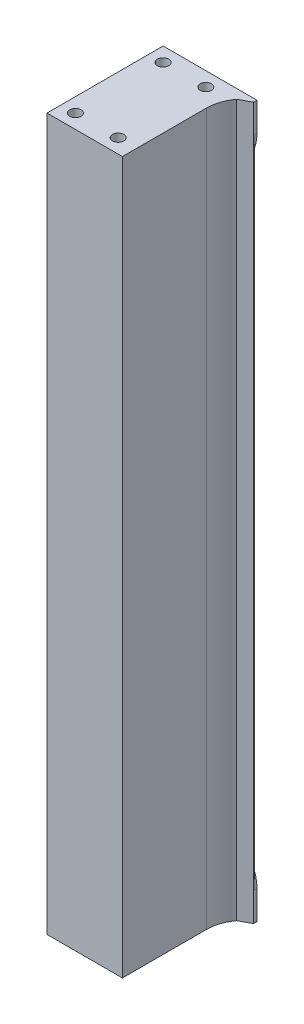
ISO-10303-21;
HEADER;
FILE_DESCRIPTION(('STEP AP214'),'2;1');
FILE_NAME('part.step','',(''),(''),'','','');
FILE_SCHEMA(('AUTOMOTIVE_DESIGN { 1 0 10303 214 1 1 1 1 }'));
ENDSEC;
DATA;
#1=APPLICATION_CONTEXT('core data for automotive mechanical design processes');
#2=APPLICATION_PROTOCOL_DEFINITION('international standard','automotive_design',2000,#1);
#3=PRODUCT_CONTEXT('',#1,'mechanical');
#4=PRODUCT('Part','Part','',(#3));
#5=PRODUCT_RELATED_PRODUCT_CATEGORY('part','',(#4));
#6=PRODUCT_DEFINITION_FORMATION('','',#4);
#7=PRODUCT_DEFINITION_CONTEXT('part definition',#1,'design');
#8=PRODUCT_DEFINITION('design','',#6,#7);
#9=PRODUCT_DEFINITION_SHAPE('','',#8);
#10=(LENGTH_UNIT() NAMED_UNIT(*) SI_UNIT(.MILLI.,.METRE.));
#11=(NAMED_UNIT(*) PLANE_ANGLE_UNIT() SI_UNIT($,.RADIAN.));
#12=(NAMED_UNIT(*) SI_UNIT($,.STERADIAN.) SOLID_ANGLE_UNIT());
#13=UNCERTAINTY_MEASURE_WITH_UNIT(LENGTH_MEASURE(1.E-05),#10,'distance_accuracy_value','');
#14=(GEOMETRIC_REPRESENTATION_CONTEXT(3) GLOBAL_UNCERTAINTY_ASSIGNED_CONTEXT((#13)) GLOBAL_UNIT_ASSIGNED_CONTEXT((#10,
#11,#12)) REPRESENTATION_CONTEXT('',''));
#15=CARTESIAN_POINT('',(0.,0.,0.));
#16=DIRECTION('',(0.,0.,1.));
#17=DIRECTION('',(1.,0.,0.));
#18=AXIS2_PLACEMENT_3D('',#15,#16,#17);
#19=CARTESIAN_POINT('',(-20.,250.,-20.));
#20=DIRECTION('',(0.,0.,1.));
#21=DIRECTION('',(1.,0.,0.));
#22=AXIS2_PLACEMENT_3D('',#19,#20,#21);
#23=PLANE('',#22);
#24=DIRECTION('',(1.,0.,0.));
#25=VECTOR('',#24,1.);
#26=CARTESIAN_POINT('',(-2.,25.,-20.));
#27=LINE('',#26,#25);
#28=CARTESIAN_POINT('',(-15.,25.,-20.));
#29=VERTEX_POINT('',#28);
#30=CARTESIAN_POINT('',(-2.,25.,-20.));
#31=VERTEX_POINT('',#30);
#32=EDGE_CURVE('E155',#29,#31,#27,.T.);
#33=ORIENTED_EDGE('',*,*,#32,.F.);
#34=DIRECTION('',(0.,-1.,0.));
#35=VECTOR('',#34,1.);
#36=CARTESIAN_POINT('',(-15.,250.,-20.));
#37=LINE('',#36,#35);
#38=CARTESIAN_POINT('',(-15.,225.,-20.));
#39=VERTEX_POINT('',#38);
#40=EDGE_CURVE('E47',#29,#39,#37,.F.);
#41=ORIENTED_EDGE('',*,*,#40,.T.);
#42=DIRECTION('',(-1.,0.,0.));
#43=VECTOR('',#42,1.);
#44=CARTESIAN_POINT('',(-2.,225.,-20.));
#45=LINE('',#44,#43);
#46=CARTESIAN_POINT('',(-2.,225.,-20.));
#47=VERTEX_POINT('',#46);
#48=EDGE_CURVE('E164',#47,#39,#45,.T.);
#49=ORIENTED_EDGE('',*,*,#48,.F.);
#50=CARTESIAN_POINT('',(-2.,240.,-20.));
#51=DIRECTION('',(0.,0.,-1.));
#52=DIRECTION('',(-1.,0.,0.));
#53=AXIS2_PLACEMENT_3D('',#50,#51,#52);
#54=CIRCLE('',#53,15.);
#55=CARTESIAN_POINT('',(13.,240.,-20.));
#56=VERTEX_POINT('',#55);
#57=EDGE_CURVE('E160',#56,#47,#54,.T.);
#58=ORIENTED_EDGE('',*,*,#57,.F.);
#59=DIRECTION('',(0.,-1.,0.));
#60=VECTOR('',#59,1.);
#61=CARTESIAN_POINT('',(13.,250.,-20.));
#62=LINE('',#61,#60);
#63=CARTESIAN_POINT('',(13.,10.,-20.));
#64=VERTEX_POINT('',#63);
#65=EDGE_CURVE('E204',#56,#64,#62,.T.);
#66=ORIENTED_EDGE('',*,*,#65,.T.);
#67=CARTESIAN_POINT('',(-2.,10.,-20.));
#68=DIRECTION('',(0.,0.,-1.));
#69=DIRECTION('',(1.,0.,0.));
#70=AXIS2_PLACEMENT_3D('',#67,#68,#69);
#71=CIRCLE('',#70,15.);
#72=EDGE_CURVE('E159',#31,#64,#71,.T.);
#73=ORIENTED_EDGE('',*,*,#72,.F.);
#74=EDGE_LOOP('',(#33,#41,#49,#58,#66,#73));
#75=FACE_BOUND('',#74,.T.);
#76=ADVANCED_FACE('F32',(#75),#23,.F.);
#77=CARTESIAN_POINT('',(-20.,250.,20.));
#78=DIRECTION('',(1.,0.,0.));
#79=DIRECTION('',(0.,0.,-1.));
#80=AXIS2_PLACEMENT_3D('',#77,#78,#79);
#81=PLANE('',#80);
#82=DIRECTION('',(0.,-1.,0.));
#83=VECTOR('',#82,1.);
#84=CARTESIAN_POINT('',(-20.,250.,-15.));
#85=LINE('',#84,#83);
#86=CARTESIAN_POINT('',(-20.,225.,-15.));
#87=VERTEX_POINT('',#86);
#88=CARTESIAN_POINT('',(-20.,25.,-15.));
#89=VERTEX_POINT('',#88);
#90=EDGE_CURVE('E230',#87,#89,#85,.T.);
#91=ORIENTED_EDGE('',*,*,#90,.T.);
#92=DIRECTION('',(0.,0.,1.));
#93=VECTOR('',#92,1.);
#94=CARTESIAN_POINT('',(-20.,25.,-20.8));
#95=LINE('',#94,#93);
#96=CARTESIAN_POINT('',(-20.,25.,-20.8));
#97=VERTEX_POINT('',#96);
#98=EDGE_CURVE('E161',#97,#89,#95,.T.);
#99=ORIENTED_EDGE('',*,*,#98,.F.);
#100=DIRECTION('',(0.,1.,0.));
#101=VECTOR('',#100,1.);
#102=CARTESIAN_POINT('',(-20.,25.,-20.8));
#103=LINE('',#102,#101);
#104=CARTESIAN_POINT('',(-20.,0.,-20.8));
#105=VERTEX_POINT('',#104);
#106=EDGE_CURVE('E254',#105,#97,#103,.T.);
#107=ORIENTED_EDGE('',*,*,#106,.F.);
#108=DIRECTION('',(0.,0.,1.));
#109=VECTOR('',#108,1.);
#110=CARTESIAN_POINT('',(-20.,0.,20.));
#111=LINE('',#110,#109);
#112=CARTESIAN_POINT('',(-20.,0.,20.));
#113=VERTEX_POINT('',#112);
#114=EDGE_CURVE('E191',#105,#113,#111,.T.);
#115=ORIENTED_EDGE('',*,*,#114,.T.);
#116=DIRECTION('',(0.,-1.,0.));
#117=VECTOR('',#116,1.);
#118=CARTESIAN_POINT('',(-20.,250.,20.));
#119=LINE('',#118,#117);
#120=CARTESIAN_POINT('',(-20.,250.,20.));
#121=VERTEX_POINT('',#120);
#122=EDGE_CURVE('E227',#121,#113,#119,.T.);
#123=ORIENTED_EDGE('',*,*,#122,.F.);
#124=DIRECTION('',(0.,0.,1.));
#125=VECTOR('',#124,1.);
#126=CARTESIAN_POINT('',(-20.,250.,20.));
#127=LINE('',#126,#125);
#128=CARTESIAN_POINT('',(-20.,250.,-20.8));
#129=VERTEX_POINT('',#128);
#130=EDGE_CURVE('E192',#129,#121,#127,.T.);
#131=ORIENTED_EDGE('',*,*,#130,.F.);
#132=DIRECTION('',(0.,1.,0.));
#133=VECTOR('',#132,1.);
#134=CARTESIAN_POINT('',(-20.,225.,-20.8));
#135=LINE('',#134,#133);
#136=CARTESIAN_POINT('',(-20.,225.,-20.8));
#137=VERTEX_POINT('',#136);
#138=EDGE_CURVE('E179',#137,#129,#135,.T.);
#139=ORIENTED_EDGE('',*,*,#138,.F.);
#140=DIRECTION('',(0.,0.,1.));
#141=VECTOR('',#140,1.);
#142=CARTESIAN_POINT('',(-20.,225.,-20.8));
#143=LINE('',#142,#141);
#144=EDGE_CURVE('E181',#137,#87,#143,.T.);
#145=ORIENTED_EDGE('',*,*,#144,.T.);
#146=EDGE_LOOP('',(#91,#99,#107,#115,#123,#131,#139,#145));
#147=FACE_BOUND('',#146,.T.);
#148=ADVANCED_FACE('F236',(#147),#81,.F.);
#149=CARTESIAN_POINT('',(6.50000000000001,250.,20.));
#150=DIRECTION('',(0.,0.,-1.));
#151=DIRECTION('',(-1.,0.,0.));
#152=AXIS2_PLACEMENT_3D('',#149,#150,#151);
#153=PLANE('',#152);
#154=DIRECTION('',(1.,0.,0.));
#155=VECTOR('',#154,1.);
#156=CARTESIAN_POINT('',(6.50000000000001,0.,20.));
#157=LINE('',#156,#155);
#158=CARTESIAN_POINT('',(6.50000000000001,0.,20.));
#159=VERTEX_POINT('',#158);
#160=EDGE_CURVE('E206',#113,#159,#157,.T.);
#161=ORIENTED_EDGE('',*,*,#160,.T.);
#162=DIRECTION('',(0.,-1.,0.));
#163=VECTOR('',#162,1.);
#164=CARTESIAN_POINT('',(6.50000000000001,250.,20.));
#165=LINE('',#164,#163);
#166=CARTESIAN_POINT('',(6.50000000000001,250.,20.));
#167=VERTEX_POINT('',#166);
#168=EDGE_CURVE('E224',#167,#159,#165,.T.);
#169=ORIENTED_EDGE('',*,*,#168,.F.);
#170=DIRECTION('',(1.,0.,0.));
#171=VECTOR('',#170,1.);
#172=CARTESIAN_POINT('',(6.50000000000001,250.,20.));
#173=LINE('',#172,#171);
#174=EDGE_CURVE('E194',#121,#167,#173,.T.);
#175=ORIENTED_EDGE('',*,*,#174,.F.);
#176=ORIENTED_EDGE('',*,*,#122,.T.);
#177=EDGE_LOOP('',(#161,#169,#175,#176));
#178=FACE_BOUND('',#177,.T.);
#179=ADVANCED_FACE('F335',(#178),#153,.F.);
#180=CARTESIAN_POINT('',(6.50000000000001,250.,-9.5));
#181=DIRECTION('',(-1.,0.,0.));
#182=DIRECTION('',(0.,0.,1.));
#183=AXIS2_PLACEMENT_3D('',#180,#181,#182);
#184=PLANE('',#183);
#185=DIRECTION('',(0.,0.,-1.));
#186=VECTOR('',#185,1.);
#187=CARTESIAN_POINT('',(6.50000000000001,0.,-9.5));
#188=LINE('',#187,#186);
#189=CARTESIAN_POINT('',(6.50000000000001,0.,-9.5));
#190=VERTEX_POINT('',#189);
#191=EDGE_CURVE('E208',#159,#190,#188,.T.);
#192=ORIENTED_EDGE('',*,*,#191,.T.);
#193=DIRECTION('',(0.,-1.,0.));
#194=VECTOR('',#193,1.);
#195=CARTESIAN_POINT('',(6.50000000000001,250.,-9.5));
#196=LINE('',#195,#194);
#197=CARTESIAN_POINT('',(6.50000000000001,250.,-9.5));
#198=VERTEX_POINT('',#197);
#199=EDGE_CURVE('E221',#198,#190,#196,.T.);
#200=ORIENTED_EDGE('',*,*,#199,.F.);
#201=DIRECTION('',(0.,0.,-1.));
#202=VECTOR('',#201,1.);
#203=CARTESIAN_POINT('',(6.50000000000001,250.,-9.5));
#204=LINE('',#203,#202);
#205=EDGE_CURVE('E196',#167,#198,#204,.T.);
#206=ORIENTED_EDGE('',*,*,#205,.F.);
#207=ORIENTED_EDGE('',*,*,#168,.T.);
#208=EDGE_LOOP('',(#192,#200,#206,#207));
#209=FACE_BOUND('',#208,.T.);
#210=ADVANCED_FACE('F340',(#209),#184,.F.);
#211=CARTESIAN_POINT('',(20.,250.,-9.5));
#212=DIRECTION('',(0.,-1.,0.));
#213=DIRECTION('',(0.,0.,-1.));
#214=AXIS2_PLACEMENT_3D('',#211,#212,#213);
#215=CYLINDRICAL_SURFACE('',#214,13.5);
#216=CARTESIAN_POINT('',(20.,0.,-9.5));
#217=DIRECTION('',(0.,-1.,0.));
#218=DIRECTION('',(0.,0.,-1.));
#219=AXIS2_PLACEMENT_3D('',#216,#217,#218);
#220=CIRCLE('',#219,13.5);
#221=CARTESIAN_POINT('',(9.12571841453424,0.,-17.5));
#222=VERTEX_POINT('',#221);
#223=EDGE_CURVE('E210',#190,#222,#220,.T.);
#224=ORIENTED_EDGE('',*,*,#223,.T.);
#225=DIRECTION('',(0.,-1.,0.));
#226=VECTOR('',#225,1.);
#227=CARTESIAN_POINT('',(9.12571841453424,250.,-17.5));
#228=LINE('',#227,#226);
#229=CARTESIAN_POINT('',(9.12571841453424,250.,-17.5));
#230=VERTEX_POINT('',#229);
#231=EDGE_CURVE('E218',#230,#222,#228,.T.);
#232=ORIENTED_EDGE('',*,*,#231,.F.);
#233=CARTESIAN_POINT('',(20.,250.,-9.5));
#234=DIRECTION('',(0.,-1.,0.));
#235=DIRECTION('',(0.,0.,-1.));
#236=AXIS2_PLACEMENT_3D('',#233,#234,#235);
#237=CIRCLE('',#236,13.5);
#238=EDGE_CURVE('E198',#198,#230,#237,.T.);
#239=ORIENTED_EDGE('',*,*,#238,.F.);
#240=ORIENTED_EDGE('',*,*,#199,.T.);
#241=EDGE_LOOP('',(#224,#232,#239,#240));
#242=FACE_BOUND('',#241,.T.);
#243=ADVANCED_FACE('F344',(#242),#215,.F.);
#244=CARTESIAN_POINT('',(9.12571841453424,250.,-17.5));
#245=DIRECTION('',(-0.476534157192947,0.,-0.879155957170517));
#246=DIRECTION('',(-0.879155957170517,0.,0.476534157192947));
#247=AXIS2_PLACEMENT_3D('',#244,#245,#246);
#248=PLANE('',#247);
#249=DIRECTION('',(0.879155957170517,0.,-0.476534157192947));
#250=VECTOR('',#249,1.);
#251=CARTESIAN_POINT('',(9.12571841453424,0.,-17.5));
#252=LINE('',#251,#250);
#253=CARTESIAN_POINT('',(13.,0.,-19.6));
#254=VERTEX_POINT('',#253);
#255=EDGE_CURVE('E212',#222,#254,#252,.T.);
#256=ORIENTED_EDGE('',*,*,#255,.T.);
#257=DIRECTION('',(0.,-1.,0.));
#258=VECTOR('',#257,1.);
#259=CARTESIAN_POINT('',(13.,250.,-19.6));
#260=LINE('',#259,#258);
#261=CARTESIAN_POINT('',(13.,250.,-19.6));
#262=VERTEX_POINT('',#261);
#263=EDGE_CURVE('E216',#262,#254,#260,.T.);
#264=ORIENTED_EDGE('',*,*,#263,.F.);
#265=DIRECTION('',(0.879155957170517,0.,-0.476534157192947));
#266=VECTOR('',#265,1.);
#267=CARTESIAN_POINT('',(9.12571841453424,250.,-17.5));
#268=LINE('',#267,#266);
#269=EDGE_CURVE('E200',#230,#262,#268,.T.);
#270=ORIENTED_EDGE('',*,*,#269,.F.);
#271=ORIENTED_EDGE('',*,*,#231,.T.);
#272=EDGE_LOOP('',(#256,#264,#270,#271));
#273=FACE_BOUND('',#272,.T.);
#274=ADVANCED_FACE('F348',(#273),#248,.F.);
#275=CARTESIAN_POINT('',(13.,250.,-20.));
#276=DIRECTION('',(-1.,0.,0.));
#277=DIRECTION('',(0.,0.,1.));
#278=AXIS2_PLACEMENT_3D('',#275,#276,#277);
#279=PLANE('',#278);
#280=DIRECTION('',(0.,0.,-1.));
#281=VECTOR('',#280,1.);
#282=CARTESIAN_POINT('',(13.,0.,-20.));
#283=LINE('',#282,#281);
#284=CARTESIAN_POINT('',(13.,0.,-20.8));
#285=VERTEX_POINT('',#284);
#286=EDGE_CURVE('E141',#254,#285,#283,.T.);
#287=ORIENTED_EDGE('',*,*,#286,.T.);
#288=DIRECTION('',(0.,-1.,0.));
#289=VECTOR('',#288,1.);
#290=CARTESIAN_POINT('',(13.,0.,-20.8));
#291=LINE('',#290,#289);
#292=CARTESIAN_POINT('',(13.,10.,-20.8));
#293=VERTEX_POINT('',#292);
#294=EDGE_CURVE('E132',#293,#285,#291,.T.);
#295=ORIENTED_EDGE('',*,*,#294,.F.);
#296=DIRECTION('',(0.,0.,1.));
#297=VECTOR('',#296,1.);
#298=CARTESIAN_POINT('',(13.,10.,-20.8));
#299=LINE('',#298,#297);
#300=EDGE_CURVE('E137',#293,#64,#299,.T.);
#301=ORIENTED_EDGE('',*,*,#300,.T.);
#302=ORIENTED_EDGE('',*,*,#65,.F.);
#303=DIRECTION('',(0.,0.,1.));
#304=VECTOR('',#303,1.);
#305=CARTESIAN_POINT('',(13.,240.,-20.8));
#306=LINE('',#305,#304);
#307=CARTESIAN_POINT('',(13.,240.,-20.8));
#308=VERTEX_POINT('',#307);
#309=EDGE_CURVE('E188',#308,#56,#306,.T.);
#310=ORIENTED_EDGE('',*,*,#309,.F.);
#311=DIRECTION('',(0.,-1.,0.));
#312=VECTOR('',#311,1.);
#313=CARTESIAN_POINT('',(13.,250.,-20.8));
#314=LINE('',#313,#312);
#315=CARTESIAN_POINT('',(13.,250.,-20.8));
#316=VERTEX_POINT('',#315);
#317=EDGE_CURVE('E173',#316,#308,#314,.T.);
#318=ORIENTED_EDGE('',*,*,#317,.F.);
#319=DIRECTION('',(0.,0.,-1.));
#320=VECTOR('',#319,1.);
#321=CARTESIAN_POINT('',(13.,250.,-20.));
#322=LINE('',#321,#320);
#323=EDGE_CURVE('E202',#262,#316,#322,.T.);
#324=ORIENTED_EDGE('',*,*,#323,.F.);
#325=ORIENTED_EDGE('',*,*,#263,.T.);
#326=EDGE_LOOP('',(#287,#295,#301,#302,#310,#318,#324,#325));
#327=FACE_BOUND('',#326,.T.);
#328=ADVANCED_FACE('F134',(#327),#279,.F.);
#329=CARTESIAN_POINT('',(20.,250.,-9.5));
#330=DIRECTION('',(0.,-1.,0.));
#331=DIRECTION('',(0.,0.,-1.));
#332=AXIS2_PLACEMENT_3D('',#329,#330,#331);
#333=PLANE('',#332);
#334=CARTESIAN_POINT('',(-15.,250.,-15.8));
#335=DIRECTION('',(0.,-1.,0.));
#336=DIRECTION('',(0.,0.,-1.));
#337=AXIS2_PLACEMENT_3D('',#334,#335,#336);
#338=CIRCLE('',#337,2.);
#339=CARTESIAN_POINT('',(-15.,250.,-17.8));
#340=VERTEX_POINT('',#339);
#341=EDGE_CURVE('E290',#340,#340,#338,.T.);
#342=ORIENTED_EDGE('',*,*,#341,.T.);
#343=EDGE_LOOP('',(#342));
#344=FACE_BOUND('',#343,.T.);
#345=CARTESIAN_POINT('',(0.,250.,-15.8));
#346=DIRECTION('',(0.,-1.,0.));
#347=DIRECTION('',(0.,0.,-1.));
#348=AXIS2_PLACEMENT_3D('',#345,#346,#347);
#349=CIRCLE('',#348,2.);
#350=CARTESIAN_POINT('',(0.,250.,-17.8));
#351=VERTEX_POINT('',#350);
#352=EDGE_CURVE('E297',#351,#351,#349,.T.);
#353=ORIENTED_EDGE('',*,*,#352,.T.);
#354=EDGE_LOOP('',(#353));
#355=FACE_BOUND('',#354,.T.);
#356=CARTESIAN_POINT('',(0.,250.,15.));
#357=DIRECTION('',(0.,-1.,0.));
#358=DIRECTION('',(0.,0.,-1.));
#359=AXIS2_PLACEMENT_3D('',#356,#357,#358);
#360=CIRCLE('',#359,2.);
#361=CARTESIAN_POINT('',(0.,250.,13.));
#362=VERTEX_POINT('',#361);
#363=EDGE_CURVE('E303',#362,#362,#360,.T.);
#364=ORIENTED_EDGE('',*,*,#363,.T.);
#365=EDGE_LOOP('',(#364));
#366=FACE_BOUND('',#365,.T.);
#367=CARTESIAN_POINT('',(-15.,250.,15.));
#368=DIRECTION('',(0.,-1.,0.));
#369=DIRECTION('',(0.,0.,-1.));
#370=AXIS2_PLACEMENT_3D('',#367,#368,#369);
#371=CIRCLE('',#370,2.);
#372=CARTESIAN_POINT('',(-15.,250.,13.));
#373=VERTEX_POINT('',#372);
#374=EDGE_CURVE('E284',#373,#373,#371,.T.);
#375=ORIENTED_EDGE('',*,*,#374,.T.);
#376=EDGE_LOOP('',(#375));
#377=FACE_BOUND('',#376,.T.);
#378=ORIENTED_EDGE('',*,*,#323,.T.);
#379=DIRECTION('',(1.,0.,0.));
#380=VECTOR('',#379,1.);
#381=CARTESIAN_POINT('',(-20.,250.,-20.8));
#382=LINE('',#381,#380);
#383=EDGE_CURVE('E170',#129,#316,#382,.T.);
#384=ORIENTED_EDGE('',*,*,#383,.F.);
#385=ORIENTED_EDGE('',*,*,#130,.T.);
#386=ORIENTED_EDGE('',*,*,#174,.T.);
#387=ORIENTED_EDGE('',*,*,#205,.T.);
#388=ORIENTED_EDGE('',*,*,#238,.T.);
#389=ORIENTED_EDGE('',*,*,#269,.T.);
#390=EDGE_LOOP('',(#378,#384,#385,#386,#387,#388,#389));
#391=FACE_BOUND('',#390,.T.);
#392=ADVANCED_FACE('F355',(#344,#355,#366,#377,#391),#333,.F.);
#393=CARTESIAN_POINT('',(20.,0.,-9.5));
#394=DIRECTION('',(0.,-1.,0.));
#395=DIRECTION('',(0.,0.,-1.));
#396=AXIS2_PLACEMENT_3D('',#393,#394,#395);
#397=PLANE('',#396);
#398=CARTESIAN_POINT('',(-15.,0.,-15.8));
#399=DIRECTION('',(0.,-1.,0.));
#400=DIRECTION('',(0.,0.,-1.));
#401=AXIS2_PLACEMENT_3D('',#398,#399,#400);
#402=CIRCLE('',#401,2.);
#403=CARTESIAN_POINT('',(-15.,0.,-17.8));
#404=VERTEX_POINT('',#403);
#405=EDGE_CURVE('E266',#404,#404,#402,.T.);
#406=ORIENTED_EDGE('',*,*,#405,.F.);
#407=EDGE_LOOP('',(#406));
#408=FACE_BOUND('',#407,.T.);
#409=CARTESIAN_POINT('',(0.,0.,-15.8));
#410=DIRECTION('',(0.,-1.,0.));
#411=DIRECTION('',(0.,0.,-1.));
#412=AXIS2_PLACEMENT_3D('',#409,#410,#411);
#413=CIRCLE('',#412,2.);
#414=CARTESIAN_POINT('',(0.,0.,-17.8));
#415=VERTEX_POINT('',#414);
#416=EDGE_CURVE('E273',#415,#415,#413,.T.);
#417=ORIENTED_EDGE('',*,*,#416,.F.);
#418=EDGE_LOOP('',(#417));
#419=FACE_BOUND('',#418,.T.);
#420=CARTESIAN_POINT('',(0.,0.,15.));
#421=DIRECTION('',(0.,-1.,0.));
#422=DIRECTION('',(0.,0.,-1.));
#423=AXIS2_PLACEMENT_3D('',#420,#421,#422);
#424=CIRCLE('',#423,2.);
#425=CARTESIAN_POINT('',(0.,0.,13.));
#426=VERTEX_POINT('',#425);
#427=EDGE_CURVE('E279',#426,#426,#424,.T.);
#428=ORIENTED_EDGE('',*,*,#427,.F.);
#429=EDGE_LOOP('',(#428));
#430=FACE_BOUND('',#429,.T.);
#431=CARTESIAN_POINT('',(-15.,0.,15.));
#432=DIRECTION('',(0.,-1.,0.));
#433=DIRECTION('',(0.,0.,-1.));
#434=AXIS2_PLACEMENT_3D('',#431,#432,#433);
#435=CIRCLE('',#434,2.);
#436=CARTESIAN_POINT('',(-15.,0.,13.));
#437=VERTEX_POINT('',#436);
#438=EDGE_CURVE('E260',#437,#437,#435,.T.);
#439=ORIENTED_EDGE('',*,*,#438,.F.);
#440=EDGE_LOOP('',(#439));
#441=FACE_BOUND('',#440,.T.);
#442=ORIENTED_EDGE('',*,*,#114,.F.);
#443=DIRECTION('',(-1.,0.,0.));
#444=VECTOR('',#443,1.);
#445=CARTESIAN_POINT('',(-20.,0.,-20.8));
#446=LINE('',#445,#444);
#447=EDGE_CURVE('E145',#285,#105,#446,.T.);
#448=ORIENTED_EDGE('',*,*,#447,.F.);
#449=ORIENTED_EDGE('',*,*,#286,.F.);
#450=ORIENTED_EDGE('',*,*,#255,.F.);
#451=ORIENTED_EDGE('',*,*,#223,.F.);
#452=ORIENTED_EDGE('',*,*,#191,.F.);
#453=ORIENTED_EDGE('',*,*,#160,.F.);
#454=EDGE_LOOP('',(#442,#448,#449,#450,#451,#452,#453));
#455=FACE_BOUND('',#454,.T.);
#456=ADVANCED_FACE('F356',(#408,#419,#430,#441,#455),#397,.T.);
#457=CARTESIAN_POINT('',(-2.,240.,-20.8));
#458=DIRECTION('',(0.,0.,1.));
#459=DIRECTION('',(1.,0.,0.));
#460=AXIS2_PLACEMENT_3D('',#457,#458,#459);
#461=CYLINDRICAL_SURFACE('',#460,15.);
#462=ORIENTED_EDGE('',*,*,#57,.T.);
#463=DIRECTION('',(0.,0.,1.));
#464=VECTOR('',#463,1.);
#465=CARTESIAN_POINT('',(-2.,225.,-20.8));
#466=LINE('',#465,#464);
#467=CARTESIAN_POINT('',(-2.,225.,-20.8));
#468=VERTEX_POINT('',#467);
#469=EDGE_CURVE('E185',#468,#47,#466,.T.);
#470=ORIENTED_EDGE('',*,*,#469,.F.);
#471=CARTESIAN_POINT('',(-2.,240.,-20.8));
#472=DIRECTION('',(0.,0.,-1.));
#473=DIRECTION('',(-1.,0.,0.));
#474=AXIS2_PLACEMENT_3D('',#471,#472,#473);
#475=CIRCLE('',#474,15.);
#476=EDGE_CURVE('E175',#308,#468,#475,.T.);
#477=ORIENTED_EDGE('',*,*,#476,.F.);
#478=ORIENTED_EDGE('',*,*,#309,.T.);
#479=EDGE_LOOP('',(#462,#470,#477,#478));
#480=FACE_BOUND('',#479,.T.);
#481=ADVANCED_FACE('F247',(#480),#461,.T.);
#482=CARTESIAN_POINT('',(-2.,225.,-20.8));
#483=DIRECTION('',(0.,1.,0.));
#484=DIRECTION('',(-1.,0.,0.));
#485=AXIS2_PLACEMENT_3D('',#482,#483,#484);
#486=PLANE('',#485);
#487=ORIENTED_EDGE('',*,*,#48,.T.);
#488=CARTESIAN_POINT('',(-15.,225.,-15.));
#489=DIRECTION('',(0.,1.,0.));
#490=DIRECTION('',(-1.,0.,0.));
#491=AXIS2_PLACEMENT_3D('',#488,#489,#490);
#492=CIRCLE('',#491,5.);
#493=EDGE_CURVE('E11',#39,#87,#492,.T.);
#494=ORIENTED_EDGE('',*,*,#493,.T.);
#495=ORIENTED_EDGE('',*,*,#144,.F.);
#496=DIRECTION('',(-1.,0.,0.));
#497=VECTOR('',#496,1.);
#498=CARTESIAN_POINT('',(-2.,225.,-20.8));
#499=LINE('',#498,#497);
#500=EDGE_CURVE('E177',#468,#137,#499,.T.);
#501=ORIENTED_EDGE('',*,*,#500,.F.);
#502=ORIENTED_EDGE('',*,*,#469,.T.);
#503=EDGE_LOOP('',(#487,#494,#495,#501,#502));
#504=FACE_BOUND('',#503,.T.);
#505=ADVANCED_FACE('F243',(#504),#486,.F.);
#506=CARTESIAN_POINT('',(-2.,240.,-20.8));
#507=DIRECTION('',(0.,0.,-1.));
#508=DIRECTION('',(-1.,0.,0.));
#509=AXIS2_PLACEMENT_3D('',#506,#507,#508);
#510=PLANE('',#509);
#511=CARTESIAN_POINT('',(-5.,240.,-20.8));
#512=DIRECTION('',(0.,0.,-1.));
#513=DIRECTION('',(-1.,0.,0.));
#514=AXIS2_PLACEMENT_3D('',#511,#512,#513);
#515=CIRCLE('',#514,2.);
#516=CARTESIAN_POINT('',(-7.,240.,-20.8));
#517=VERTEX_POINT('',#516);
#518=EDGE_CURVE('E308',#517,#517,#515,.T.);
#519=ORIENTED_EDGE('',*,*,#518,.F.);
#520=EDGE_LOOP('',(#519));
#521=FACE_BOUND('',#520,.T.);
#522=ORIENTED_EDGE('',*,*,#383,.T.);
#523=ORIENTED_EDGE('',*,*,#317,.T.);
#524=ORIENTED_EDGE('',*,*,#476,.T.);
#525=ORIENTED_EDGE('',*,*,#500,.T.);
#526=ORIENTED_EDGE('',*,*,#138,.T.);
#527=EDGE_LOOP('',(#522,#523,#524,#525,#526));
#528=FACE_BOUND('',#527,.T.);
#529=ADVANCED_FACE('F367',(#521,#528),#510,.T.);
#530=CARTESIAN_POINT('',(-2.,10.,-20.8));
#531=DIRECTION('',(0.,0.,1.));
#532=DIRECTION('',(1.,0.,0.));
#533=AXIS2_PLACEMENT_3D('',#530,#531,#532);
#534=CYLINDRICAL_SURFACE('',#533,15.);
#535=ORIENTED_EDGE('',*,*,#72,.T.);
#536=ORIENTED_EDGE('',*,*,#300,.F.);
#537=CARTESIAN_POINT('',(-2.,10.,-20.8));
#538=DIRECTION('',(0.,0.,-1.));
#539=DIRECTION('',(1.,0.,0.));
#540=AXIS2_PLACEMENT_3D('',#537,#538,#539);
#541=CIRCLE('',#540,15.);
#542=CARTESIAN_POINT('',(-2.,25.,-20.8));
#543=VERTEX_POINT('',#542);
#544=EDGE_CURVE('E146',#543,#293,#541,.T.);
#545=ORIENTED_EDGE('',*,*,#544,.F.);
#546=DIRECTION('',(0.,0.,1.));
#547=VECTOR('',#546,1.);
#548=CARTESIAN_POINT('',(-2.,25.,-20.8));
#549=LINE('',#548,#547);
#550=EDGE_CURVE('E166',#543,#31,#549,.T.);
#551=ORIENTED_EDGE('',*,*,#550,.T.);
#552=EDGE_LOOP('',(#535,#536,#545,#551));
#553=FACE_BOUND('',#552,.T.);
#554=ADVANCED_FACE('F157',(#553),#534,.T.);
#555=CARTESIAN_POINT('',(-2.,25.,-20.8));
#556=DIRECTION('',(0.,-1.,0.));
#557=DIRECTION('',(1.,0.,0.));
#558=AXIS2_PLACEMENT_3D('',#555,#556,#557);
#559=PLANE('',#558);
#560=ORIENTED_EDGE('',*,*,#98,.T.);
#561=CARTESIAN_POINT('',(-15.,25.,-15.));
#562=DIRECTION('',(0.,-1.,0.));
#563=DIRECTION('',(1.,0.,0.));
#564=AXIS2_PLACEMENT_3D('',#561,#562,#563);
#565=CIRCLE('',#564,5.);
#566=EDGE_CURVE('E40',#89,#29,#565,.T.);
#567=ORIENTED_EDGE('',*,*,#566,.T.);
#568=ORIENTED_EDGE('',*,*,#32,.T.);
#569=ORIENTED_EDGE('',*,*,#550,.F.);
#570=DIRECTION('',(1.,0.,0.));
#571=VECTOR('',#570,1.);
#572=CARTESIAN_POINT('',(-2.,25.,-20.8));
#573=LINE('',#572,#571);
#574=EDGE_CURVE('E151',#97,#543,#573,.T.);
#575=ORIENTED_EDGE('',*,*,#574,.F.);
#576=EDGE_LOOP('',(#560,#567,#568,#569,#575));
#577=FACE_BOUND('',#576,.T.);
#578=ADVANCED_FACE('F373',(#577),#559,.F.);
#579=CARTESIAN_POINT('',(-2.,10.,-20.8));
#580=DIRECTION('',(0.,0.,1.));
#581=DIRECTION('',(1.,0.,0.));
#582=AXIS2_PLACEMENT_3D('',#579,#580,#581);
#583=PLANE('',#582);
#584=CARTESIAN_POINT('',(-5.,10.,-20.8));
#585=DIRECTION('',(0.,0.,1.));
#586=DIRECTION('',(-1.,0.,0.));
#587=AXIS2_PLACEMENT_3D('',#584,#585,#586);
#588=CIRCLE('',#587,2.);
#589=CARTESIAN_POINT('',(-7.,10.,-20.8));
#590=VERTEX_POINT('',#589);
#591=EDGE_CURVE('E314',#590,#590,#588,.T.);
#592=ORIENTED_EDGE('',*,*,#591,.T.);
#593=EDGE_LOOP('',(#592));
#594=FACE_BOUND('',#593,.T.);
#595=ORIENTED_EDGE('',*,*,#544,.T.);
#596=ORIENTED_EDGE('',*,*,#294,.T.);
#597=ORIENTED_EDGE('',*,*,#447,.T.);
#598=ORIENTED_EDGE('',*,*,#106,.T.);
#599=ORIENTED_EDGE('',*,*,#574,.T.);
#600=EDGE_LOOP('',(#595,#596,#597,#598,#599));
#601=FACE_BOUND('',#600,.T.);
#602=ADVANCED_FACE('F149',(#594,#601),#583,.F.);
#603=CARTESIAN_POINT('',(-15.,8.,15.));
#604=DIRECTION('',(0.,-1.,0.));
#605=DIRECTION('',(0.,0.,-1.));
#606=AXIS2_PLACEMENT_3D('',#603,#604,#605);
#607=CYLINDRICAL_SURFACE('',#606,2.);
#608=CARTESIAN_POINT('',(-15.,8.,15.));
#609=DIRECTION('',(0.,-1.,0.));
#610=DIRECTION('',(0.,0.,-1.));
#611=AXIS2_PLACEMENT_3D('',#608,#609,#610);
#612=CIRCLE('',#611,2.);
#613=CARTESIAN_POINT('',(-15.,8.,13.));
#614=VERTEX_POINT('',#613);
#615=EDGE_CURVE('E252',#614,#614,#612,.T.);
#616=ORIENTED_EDGE('',*,*,#615,.F.);
#617=EDGE_LOOP('',(#616));
#618=FACE_BOUND('',#617,.T.);
#619=ORIENTED_EDGE('',*,*,#438,.T.);
#620=EDGE_LOOP('',(#619));
#621=FACE_BOUND('',#620,.T.);
#622=ADVANCED_FACE('F378',(#618,#621),#607,.F.);
#623=CARTESIAN_POINT('',(-15.,8.,15.));
#624=DIRECTION('',(0.,-1.,0.));
#625=DIRECTION('',(0.,0.,-1.));
#626=AXIS2_PLACEMENT_3D('',#623,#624,#625);
#627=PLANE('',#626);
#628=ORIENTED_EDGE('',*,*,#615,.T.);
#629=EDGE_LOOP('',(#628));
#630=FACE_BOUND('',#629,.T.);
#631=ADVANCED_FACE('F382',(#630),#627,.T.);
#632=CARTESIAN_POINT('',(0.,8.,15.));
#633=DIRECTION('',(0.,-1.,0.));
#634=DIRECTION('',(0.,0.,-1.));
#635=AXIS2_PLACEMENT_3D('',#632,#633,#634);
#636=CYLINDRICAL_SURFACE('',#635,2.);
#637=CARTESIAN_POINT('',(0.,8.,15.));
#638=DIRECTION('',(0.,-1.,0.));
#639=DIRECTION('',(0.,0.,-1.));
#640=AXIS2_PLACEMENT_3D('',#637,#638,#639);
#641=CIRCLE('',#640,2.);
#642=CARTESIAN_POINT('',(0.,8.,13.));
#643=VERTEX_POINT('',#642);
#644=EDGE_CURVE('E263',#643,#643,#641,.T.);
#645=ORIENTED_EDGE('',*,*,#644,.F.);
#646=EDGE_LOOP('',(#645));
#647=FACE_BOUND('',#646,.T.);
#648=ORIENTED_EDGE('',*,*,#427,.T.);
#649=EDGE_LOOP('',(#648));
#650=FACE_BOUND('',#649,.T.);
#651=ADVANCED_FACE('F386',(#647,#650),#636,.F.);
#652=CARTESIAN_POINT('',(0.,8.,15.));
#653=DIRECTION('',(0.,-1.,0.));
#654=DIRECTION('',(0.,0.,-1.));
#655=AXIS2_PLACEMENT_3D('',#652,#653,#654);
#656=PLANE('',#655);
#657=ORIENTED_EDGE('',*,*,#644,.T.);
#658=EDGE_LOOP('',(#657));
#659=FACE_BOUND('',#658,.T.);
#660=ADVANCED_FACE('F401',(#659),#656,.T.);
#661=CARTESIAN_POINT('',(0.,8.,-15.8));
#662=DIRECTION('',(0.,-1.,0.));
#663=DIRECTION('',(0.,0.,-1.));
#664=AXIS2_PLACEMENT_3D('',#661,#662,#663);
#665=CYLINDRICAL_SURFACE('',#664,2.);
#666=CARTESIAN_POINT('',(0.,8.,-15.8));
#667=DIRECTION('',(0.,-1.,0.));
#668=DIRECTION('',(0.,0.,-1.));
#669=AXIS2_PLACEMENT_3D('',#666,#667,#668);
#670=CIRCLE('',#669,2.);
#671=CARTESIAN_POINT('',(0.,8.,-17.8));
#672=VERTEX_POINT('',#671);
#673=EDGE_CURVE('E276',#672,#672,#670,.T.);
#674=ORIENTED_EDGE('',*,*,#673,.F.);
#675=EDGE_LOOP('',(#674));
#676=FACE_BOUND('',#675,.T.);
#677=ORIENTED_EDGE('',*,*,#416,.T.);
#678=EDGE_LOOP('',(#677));
#679=FACE_BOUND('',#678,.T.);
#680=ADVANCED_FACE('F398',(#676,#679),#665,.F.);
#681=CARTESIAN_POINT('',(0.,8.,-15.8));
#682=DIRECTION('',(0.,-1.,0.));
#683=DIRECTION('',(0.,0.,-1.));
#684=AXIS2_PLACEMENT_3D('',#681,#682,#683);
#685=PLANE('',#684);
#686=ORIENTED_EDGE('',*,*,#673,.T.);
#687=EDGE_LOOP('',(#686));
#688=FACE_BOUND('',#687,.T.);
#689=ADVANCED_FACE('F392',(#688),#685,.T.);
#690=CARTESIAN_POINT('',(-15.,8.,-15.8));
#691=DIRECTION('',(0.,-1.,0.));
#692=DIRECTION('',(0.,0.,-1.));
#693=AXIS2_PLACEMENT_3D('',#690,#691,#692);
#694=CYLINDRICAL_SURFACE('',#693,2.);
#695=CARTESIAN_POINT('',(-15.,8.,-15.8));
#696=DIRECTION('',(0.,-1.,0.));
#697=DIRECTION('',(0.,0.,-1.));
#698=AXIS2_PLACEMENT_3D('',#695,#696,#697);
#699=CIRCLE('',#698,2.);
#700=CARTESIAN_POINT('',(-15.,8.,-17.8));
#701=VERTEX_POINT('',#700);
#702=EDGE_CURVE('E269',#701,#701,#699,.T.);
#703=ORIENTED_EDGE('',*,*,#702,.F.);
#704=EDGE_LOOP('',(#703));
#705=FACE_BOUND('',#704,.T.);
#706=ORIENTED_EDGE('',*,*,#405,.T.);
#707=EDGE_LOOP('',(#706));
#708=FACE_BOUND('',#707,.T.);
#709=ADVANCED_FACE('F388',(#705,#708),#694,.F.);
#710=CARTESIAN_POINT('',(-15.,8.,-15.8));
#711=DIRECTION('',(0.,-1.,0.));
#712=DIRECTION('',(0.,0.,-1.));
#713=AXIS2_PLACEMENT_3D('',#710,#711,#712);
#714=PLANE('',#713);
#715=ORIENTED_EDGE('',*,*,#702,.T.);
#716=EDGE_LOOP('',(#715));
#717=FACE_BOUND('',#716,.T.);
#718=ADVANCED_FACE('F391',(#717),#714,.T.);
#719=CARTESIAN_POINT('',(-15.,242.,15.));
#720=DIRECTION('',(0.,1.,0.));
#721=DIRECTION('',(0.,0.,1.));
#722=AXIS2_PLACEMENT_3D('',#719,#720,#721);
#723=CYLINDRICAL_SURFACE('',#722,2.);
#724=CARTESIAN_POINT('',(-15.,242.,15.));
#725=DIRECTION('',(0.,-1.,0.));
#726=DIRECTION('',(0.,0.,-1.));
#727=AXIS2_PLACEMENT_3D('',#724,#725,#726);
#728=CIRCLE('',#727,2.);
#729=CARTESIAN_POINT('',(-15.,242.,13.));
#730=VERTEX_POINT('',#729);
#731=EDGE_CURVE('E270',#730,#730,#728,.T.);
#732=ORIENTED_EDGE('',*,*,#731,.T.);
#733=EDGE_LOOP('',(#732));
#734=FACE_BOUND('',#733,.T.);
#735=ORIENTED_EDGE('',*,*,#374,.F.);
#736=EDGE_LOOP('',(#735));
#737=FACE_BOUND('',#736,.T.);
#738=ADVANCED_FACE('F396',(#734,#737),#723,.F.);
#739=CARTESIAN_POINT('',(-15.,242.,15.));
#740=DIRECTION('',(0.,1.,0.));
#741=DIRECTION('',(0.,0.,-1.));
#742=AXIS2_PLACEMENT_3D('',#739,#740,#741);
#743=PLANE('',#742);
#744=ORIENTED_EDGE('',*,*,#731,.F.);
#745=EDGE_LOOP('',(#744));
#746=FACE_BOUND('',#745,.T.);
#747=ADVANCED_FACE('F414',(#746),#743,.T.);
#748=CARTESIAN_POINT('',(0.,242.,15.));
#749=DIRECTION('',(0.,1.,0.));
#750=DIRECTION('',(0.,0.,1.));
#751=AXIS2_PLACEMENT_3D('',#748,#749,#750);
#752=CYLINDRICAL_SURFACE('',#751,2.);
#753=CARTESIAN_POINT('',(0.,242.,15.));
#754=DIRECTION('',(0.,-1.,0.));
#755=DIRECTION('',(0.,0.,-1.));
#756=AXIS2_PLACEMENT_3D('',#753,#754,#755);
#757=CIRCLE('',#756,2.);
#758=CARTESIAN_POINT('',(0.,242.,13.));
#759=VERTEX_POINT('',#758);
#760=EDGE_CURVE('E287',#759,#759,#757,.T.);
#761=ORIENTED_EDGE('',*,*,#760,.T.);
#762=EDGE_LOOP('',(#761));
#763=FACE_BOUND('',#762,.T.);
#764=ORIENTED_EDGE('',*,*,#363,.F.);
#765=EDGE_LOOP('',(#764));
#766=FACE_BOUND('',#765,.T.);
#767=ADVANCED_FACE('F418',(#763,#766),#752,.F.);
#768=CARTESIAN_POINT('',(0.,242.,15.));
#769=DIRECTION('',(0.,1.,0.));
#770=DIRECTION('',(0.,0.,-1.));
#771=AXIS2_PLACEMENT_3D('',#768,#769,#770);
#772=PLANE('',#771);
#773=ORIENTED_EDGE('',*,*,#760,.F.);
#774=EDGE_LOOP('',(#773));
#775=FACE_BOUND('',#774,.T.);
#776=ADVANCED_FACE('F432',(#775),#772,.T.);
#777=CARTESIAN_POINT('',(0.,242.,-15.8));
#778=DIRECTION('',(0.,1.,0.));
#779=DIRECTION('',(0.,0.,1.));
#780=AXIS2_PLACEMENT_3D('',#777,#778,#779);
#781=CYLINDRICAL_SURFACE('',#780,2.);
#782=CARTESIAN_POINT('',(0.,242.,-15.8));
#783=DIRECTION('',(0.,-1.,0.));
#784=DIRECTION('',(0.,0.,-1.));
#785=AXIS2_PLACEMENT_3D('',#782,#783,#784);
#786=CIRCLE('',#785,2.);
#787=CARTESIAN_POINT('',(0.,242.,-17.8));
#788=VERTEX_POINT('',#787);
#789=EDGE_CURVE('E300',#788,#788,#786,.T.);
#790=ORIENTED_EDGE('',*,*,#789,.T.);
#791=EDGE_LOOP('',(#790));
#792=FACE_BOUND('',#791,.T.);
#793=ORIENTED_EDGE('',*,*,#352,.F.);
#794=EDGE_LOOP('',(#793));
#795=FACE_BOUND('',#794,.T.);
#796=ADVANCED_FACE('F429',(#792,#795),#781,.F.);
#797=CARTESIAN_POINT('',(0.,242.,-15.8));
#798=DIRECTION('',(0.,1.,0.));
#799=DIRECTION('',(0.,0.,-1.));
#800=AXIS2_PLACEMENT_3D('',#797,#798,#799);
#801=PLANE('',#800);
#802=ORIENTED_EDGE('',*,*,#789,.F.);
#803=EDGE_LOOP('',(#802));
#804=FACE_BOUND('',#803,.T.);
#805=ADVANCED_FACE('F424',(#804),#801,.T.);
#806=CARTESIAN_POINT('',(-15.,242.,-15.8));
#807=DIRECTION('',(0.,1.,0.));
#808=DIRECTION('',(0.,0.,1.));
#809=AXIS2_PLACEMENT_3D('',#806,#807,#808);
#810=CYLINDRICAL_SURFACE('',#809,2.);
#811=CARTESIAN_POINT('',(-15.,242.,-15.8));
#812=DIRECTION('',(0.,-1.,0.));
#813=DIRECTION('',(0.,0.,-1.));
#814=AXIS2_PLACEMENT_3D('',#811,#812,#813);
#815=CIRCLE('',#814,2.);
#816=CARTESIAN_POINT('',(-15.,242.,-17.8));
#817=VERTEX_POINT('',#816);
#818=EDGE_CURVE('E293',#817,#817,#815,.T.);
#819=ORIENTED_EDGE('',*,*,#818,.T.);
#820=EDGE_LOOP('',(#819));
#821=FACE_BOUND('',#820,.T.);
#822=ORIENTED_EDGE('',*,*,#341,.F.);
#823=EDGE_LOOP('',(#822));
#824=FACE_BOUND('',#823,.T.);
#825=ADVANCED_FACE('F420',(#821,#824),#810,.F.);
#826=CARTESIAN_POINT('',(-15.,242.,-15.8));
#827=DIRECTION('',(0.,1.,0.));
#828=DIRECTION('',(0.,0.,-1.));
#829=AXIS2_PLACEMENT_3D('',#826,#827,#828);
#830=PLANE('',#829);
#831=ORIENTED_EDGE('',*,*,#818,.F.);
#832=EDGE_LOOP('',(#831));
#833=FACE_BOUND('',#832,.T.);
#834=ADVANCED_FACE('F423',(#833),#830,.T.);
#835=CARTESIAN_POINT('',(-15.,250.,-15.));
#836=DIRECTION('',(0.,-1.,0.));
#837=DIRECTION('',(0.,0.,-1.));
#838=AXIS2_PLACEMENT_3D('',#835,#836,#837);
#839=CYLINDRICAL_SURFACE('',#838,5.);
#840=ORIENTED_EDGE('',*,*,#493,.F.);
#841=ORIENTED_EDGE('',*,*,#40,.F.);
#842=ORIENTED_EDGE('',*,*,#566,.F.);
#843=ORIENTED_EDGE('',*,*,#90,.F.);
#844=EDGE_LOOP('',(#840,#841,#842,#843));
#845=FACE_BOUND('',#844,.T.);
#846=ADVANCED_FACE('F34',(#845),#839,.T.);
#847=CARTESIAN_POINT('',(-5.,240.,-12.8));
#848=DIRECTION('',(0.,0.,-1.));
#849=DIRECTION('',(-1.,0.,0.));
#850=AXIS2_PLACEMENT_3D('',#847,#848,#849);
#851=CYLINDRICAL_SURFACE('',#850,2.);
#852=CARTESIAN_POINT('',(-5.,240.,-12.8));
#853=DIRECTION('',(0.,0.,-1.));
#854=DIRECTION('',(-1.,0.,0.));
#855=AXIS2_PLACEMENT_3D('',#852,#853,#854);
#856=CIRCLE('',#855,2.);
#857=CARTESIAN_POINT('',(-7.,240.,-12.8));
#858=VERTEX_POINT('',#857);
#859=EDGE_CURVE('E294',#858,#858,#856,.T.);
#860=ORIENTED_EDGE('',*,*,#859,.F.);
#861=EDGE_LOOP('',(#860));
#862=FACE_BOUND('',#861,.T.);
#863=ORIENTED_EDGE('',*,*,#518,.T.);
#864=EDGE_LOOP('',(#863));
#865=FACE_BOUND('',#864,.T.);
#866=ADVANCED_FACE('F443',(#862,#865),#851,.F.);
#867=CARTESIAN_POINT('',(-5.,240.,-12.8));
#868=DIRECTION('',(0.,0.,-1.));
#869=DIRECTION('',(-1.,0.,0.));
#870=AXIS2_PLACEMENT_3D('',#867,#868,#869);
#871=PLANE('',#870);
#872=ORIENTED_EDGE('',*,*,#859,.T.);
#873=EDGE_LOOP('',(#872));
#874=FACE_BOUND('',#873,.T.);
#875=ADVANCED_FACE('F329',(#874),#871,.T.);
#876=CARTESIAN_POINT('',(-5.,10.,-12.8));
#877=DIRECTION('',(0.,0.,-1.));
#878=DIRECTION('',(-1.,0.,0.));
#879=AXIS2_PLACEMENT_3D('',#876,#877,#878);
#880=CYLINDRICAL_SURFACE('',#879,2.);
#881=CARTESIAN_POINT('',(-5.,10.,-12.8));
#882=DIRECTION('',(0.,0.,1.));
#883=DIRECTION('',(-1.,0.,0.));
#884=AXIS2_PLACEMENT_3D('',#881,#882,#883);
#885=CIRCLE('',#884,2.);
#886=CARTESIAN_POINT('',(-7.,10.,-12.8));
#887=VERTEX_POINT('',#886);
#888=EDGE_CURVE('E311',#887,#887,#885,.T.);
#889=ORIENTED_EDGE('',*,*,#888,.T.);
#890=EDGE_LOOP('',(#889));
#891=FACE_BOUND('',#890,.T.);
#892=ORIENTED_EDGE('',*,*,#591,.F.);
#893=EDGE_LOOP('',(#892));
#894=FACE_BOUND('',#893,.T.);
#895=ADVANCED_FACE('F320',(#891,#894),#880,.F.);
#896=CARTESIAN_POINT('',(-5.,10.,-12.8));
#897=DIRECTION('',(0.,0.,-1.));
#898=DIRECTION('',(-1.,0.,0.));
#899=AXIS2_PLACEMENT_3D('',#896,#897,#898);
#900=PLANE('',#899);
#901=ORIENTED_EDGE('',*,*,#888,.F.);
#902=EDGE_LOOP('',(#901));
#903=FACE_BOUND('',#902,.T.);
#904=ADVANCED_FACE('F323',(#903),#900,.T.);
#905=CLOSED_SHELL('',(#76,#148,#179,#210,#243,#274,#328,#392,#456,#481,#505,#529,#554,#578,#602,
#622,#631,#651,#660,#680,#689,#709,#718,#738,#747,#767,#776,#796,#805,#825,#834,#846,#866,#875,
#895,#904));
#906=MANIFOLD_SOLID_BREP('B2',#905);
#907=ADVANCED_BREP_SHAPE_REPRESENTATION('',(#18,#906),#14);
#908=SHAPE_DEFINITION_REPRESENTATION(#9,#907);
ENDSEC;
END-ISO-10303-21;
